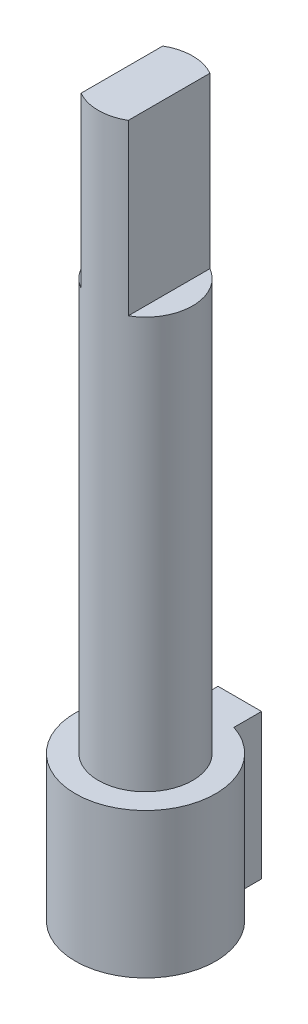
ISO-10303-21;
HEADER;
FILE_DESCRIPTION(('STEP AP214'),'2;1');
FILE_NAME('part.step','',(''),(''),'','','');
FILE_SCHEMA(('AUTOMOTIVE_DESIGN { 1 0 10303 214 1 1 1 1 }'));
ENDSEC;
DATA;
#1=APPLICATION_CONTEXT('core data for automotive mechanical design processes');
#2=APPLICATION_PROTOCOL_DEFINITION('international standard','automotive_design',2000,#1);
#3=PRODUCT_CONTEXT('',#1,'mechanical');
#4=PRODUCT('Part','Part','',(#3));
#5=PRODUCT_RELATED_PRODUCT_CATEGORY('part','',(#4));
#6=PRODUCT_DEFINITION_FORMATION('','',#4);
#7=PRODUCT_DEFINITION_CONTEXT('part definition',#1,'design');
#8=PRODUCT_DEFINITION('design','',#6,#7);
#9=PRODUCT_DEFINITION_SHAPE('','',#8);
#10=(LENGTH_UNIT() NAMED_UNIT(*) SI_UNIT(.MILLI.,.METRE.));
#11=(NAMED_UNIT(*) PLANE_ANGLE_UNIT() SI_UNIT($,.RADIAN.));
#12=(NAMED_UNIT(*) SI_UNIT($,.STERADIAN.) SOLID_ANGLE_UNIT());
#13=UNCERTAINTY_MEASURE_WITH_UNIT(LENGTH_MEASURE(1.E-05),#10,'distance_accuracy_value','');
#14=(GEOMETRIC_REPRESENTATION_CONTEXT(3) GLOBAL_UNCERTAINTY_ASSIGNED_CONTEXT((#13)) GLOBAL_UNIT_ASSIGNED_CONTEXT((#10,
#11,#12)) REPRESENTATION_CONTEXT('',''));
#15=CARTESIAN_POINT('',(0.,0.,0.));
#16=DIRECTION('',(0.,0.,1.));
#17=DIRECTION('',(1.,0.,0.));
#18=AXIS2_PLACEMENT_3D('',#15,#16,#17);
#19=CARTESIAN_POINT('',(0.,8.,0.));
#20=DIRECTION('',(0.,1.,0.));
#21=DIRECTION('',(0.,0.,1.));
#22=AXIS2_PLACEMENT_3D('',#19,#20,#21);
#23=CYLINDRICAL_SURFACE('',#22,1.95);
#24=DIRECTION('',(0.,1.,0.));
#25=VECTOR('',#24,1.);
#26=CARTESIAN_POINT('',(-0.975,23.,-1.68874953737966));
#27=LINE('',#26,#25);
#28=CARTESIAN_POINT('',(-0.975,23.,-1.68874953737966));
#29=VERTEX_POINT('',#28);
#30=CARTESIAN_POINT('',(-0.975,30.,-1.68874953737966));
#31=VERTEX_POINT('',#30);
#32=EDGE_CURVE('E147',#29,#31,#27,.T.);
#33=ORIENTED_EDGE('',*,*,#32,.T.);
#34=CARTESIAN_POINT('',(0.,30.,0.));
#35=DIRECTION('',(0.,1.,0.));
#36=DIRECTION('',(0.,0.,1.));
#37=AXIS2_PLACEMENT_3D('',#34,#35,#36);
#38=CIRCLE('',#37,1.95);
#39=CARTESIAN_POINT('',(0.975,30.,-1.68874953737966));
#40=VERTEX_POINT('',#39);
#41=EDGE_CURVE('E50',#40,#31,#38,.T.);
#42=ORIENTED_EDGE('',*,*,#41,.F.);
#43=DIRECTION('',(0.,1.,0.));
#44=VECTOR('',#43,1.);
#45=CARTESIAN_POINT('',(0.975,23.,-1.68874953737966));
#46=LINE('',#45,#44);
#47=CARTESIAN_POINT('',(0.975,23.,-1.68874953737966));
#48=VERTEX_POINT('',#47);
#49=EDGE_CURVE('E162',#48,#40,#46,.T.);
#50=ORIENTED_EDGE('',*,*,#49,.F.);
#51=CARTESIAN_POINT('',(0.,23.,0.));
#52=DIRECTION('',(0.,1.,0.));
#53=DIRECTION('',(0.,0.,1.));
#54=AXIS2_PLACEMENT_3D('',#51,#52,#53);
#55=CIRCLE('',#54,1.95);
#56=CARTESIAN_POINT('',(0.975,23.,1.68874953737966));
#57=VERTEX_POINT('',#56);
#58=EDGE_CURVE('E154',#57,#48,#55,.T.);
#59=ORIENTED_EDGE('',*,*,#58,.F.);
#60=DIRECTION('',(0.,1.,0.));
#61=VECTOR('',#60,1.);
#62=CARTESIAN_POINT('',(0.975,23.,1.68874953737966));
#63=LINE('',#62,#61);
#64=CARTESIAN_POINT('',(0.975,30.,1.68874953737966));
#65=VERTEX_POINT('',#64);
#66=EDGE_CURVE('E146',#57,#65,#63,.T.);
#67=ORIENTED_EDGE('',*,*,#66,.T.);
#68=CARTESIAN_POINT('',(-0.975,30.,1.68874953737966));
#69=VERTEX_POINT('',#68);
#70=EDGE_CURVE('E151',#69,#65,#38,.T.);
#71=ORIENTED_EDGE('',*,*,#70,.F.);
#72=DIRECTION('',(0.,1.,0.));
#73=VECTOR('',#72,1.);
#74=CARTESIAN_POINT('',(-0.975,23.,1.68874953737966));
#75=LINE('',#74,#73);
#76=CARTESIAN_POINT('',(-0.975,23.,1.68874953737966));
#77=VERTEX_POINT('',#76);
#78=EDGE_CURVE('E143',#77,#69,#75,.T.);
#79=ORIENTED_EDGE('',*,*,#78,.F.);
#80=CARTESIAN_POINT('',(0.,23.,0.));
#81=DIRECTION('',(0.,1.,0.));
#82=DIRECTION('',(0.,0.,1.));
#83=AXIS2_PLACEMENT_3D('',#80,#81,#82);
#84=CIRCLE('',#83,1.95);
#85=EDGE_CURVE('E135',#29,#77,#84,.T.);
#86=ORIENTED_EDGE('',*,*,#85,.F.);
#87=EDGE_LOOP('',(#33,#42,#50,#59,#67,#71,#79,#86));
#88=FACE_BOUND('',#87,.T.);
#89=CARTESIAN_POINT('',(0.,6.,0.));
#90=DIRECTION('',(0.,1.,0.));
#91=DIRECTION('',(0.,0.,1.));
#92=AXIS2_PLACEMENT_3D('',#89,#90,#91);
#93=CIRCLE('',#92,1.95);
#94=CARTESIAN_POINT('',(0.,6.,1.95));
#95=VERTEX_POINT('',#94);
#96=EDGE_CURVE('E115',#95,#95,#93,.T.);
#97=ORIENTED_EDGE('',*,*,#96,.T.);
#98=EDGE_LOOP('',(#97));
#99=FACE_BOUND('',#98,.T.);
#100=ADVANCED_FACE('F41',(#88,#99),#23,.T.);
#101=CARTESIAN_POINT('',(0.,30.,0.));
#102=DIRECTION('',(0.,1.,0.));
#103=DIRECTION('',(0.,0.,1.));
#104=AXIS2_PLACEMENT_3D('',#101,#102,#103);
#105=PLANE('',#104);
#106=DIRECTION('',(0.,0.,-1.));
#107=VECTOR('',#106,1.);
#108=CARTESIAN_POINT('',(-0.975,30.,-1.68874953737966));
#109=LINE('',#108,#107);
#110=EDGE_CURVE('E139',#69,#31,#109,.T.);
#111=ORIENTED_EDGE('',*,*,#110,.F.);
#112=ORIENTED_EDGE('',*,*,#70,.T.);
#113=DIRECTION('',(0.,0.,1.));
#114=VECTOR('',#113,1.);
#115=CARTESIAN_POINT('',(0.975,30.,-1.68874953737966));
#116=LINE('',#115,#114);
#117=EDGE_CURVE('E158',#40,#65,#116,.T.);
#118=ORIENTED_EDGE('',*,*,#117,.F.);
#119=ORIENTED_EDGE('',*,*,#41,.T.);
#120=EDGE_LOOP('',(#111,#112,#118,#119));
#121=FACE_BOUND('',#120,.T.);
#122=ADVANCED_FACE('F178',(#121),#105,.T.);
#123=CARTESIAN_POINT('',(0.975,23.,-1.68874953737966));
#124=DIRECTION('',(-1.,0.,0.));
#125=DIRECTION('',(0.,0.,1.));
#126=AXIS2_PLACEMENT_3D('',#123,#124,#125);
#127=PLANE('',#126);
#128=ORIENTED_EDGE('',*,*,#117,.T.);
#129=ORIENTED_EDGE('',*,*,#66,.F.);
#130=DIRECTION('',(0.,0.,1.));
#131=VECTOR('',#130,1.);
#132=CARTESIAN_POINT('',(0.975,23.,-1.68874953737966));
#133=LINE('',#132,#131);
#134=EDGE_CURVE('E157',#48,#57,#133,.T.);
#135=ORIENTED_EDGE('',*,*,#134,.F.);
#136=ORIENTED_EDGE('',*,*,#49,.T.);
#137=EDGE_LOOP('',(#128,#129,#135,#136));
#138=FACE_BOUND('',#137,.T.);
#139=ADVANCED_FACE('F205',(#138),#127,.F.);
#140=CARTESIAN_POINT('',(0.,23.,0.));
#141=DIRECTION('',(0.,1.,0.));
#142=DIRECTION('',(0.,0.,1.));
#143=AXIS2_PLACEMENT_3D('',#140,#141,#142);
#144=PLANE('',#143);
#145=ORIENTED_EDGE('',*,*,#58,.T.);
#146=ORIENTED_EDGE('',*,*,#134,.T.);
#147=EDGE_LOOP('',(#145,#146));
#148=FACE_BOUND('',#147,.T.);
#149=ADVANCED_FACE('F197',(#148),#144,.T.);
#150=CARTESIAN_POINT('',(-0.975,23.,-1.68874953737966));
#151=DIRECTION('',(1.,0.,0.));
#152=DIRECTION('',(0.,0.,-1.));
#153=AXIS2_PLACEMENT_3D('',#150,#151,#152);
#154=PLANE('',#153);
#155=ORIENTED_EDGE('',*,*,#110,.T.);
#156=ORIENTED_EDGE('',*,*,#32,.F.);
#157=DIRECTION('',(0.,0.,-1.));
#158=VECTOR('',#157,1.);
#159=CARTESIAN_POINT('',(-0.975,23.,-1.68874953737966));
#160=LINE('',#159,#158);
#161=EDGE_CURVE('E138',#77,#29,#160,.T.);
#162=ORIENTED_EDGE('',*,*,#161,.F.);
#163=ORIENTED_EDGE('',*,*,#78,.T.);
#164=EDGE_LOOP('',(#155,#156,#162,#163));
#165=FACE_BOUND('',#164,.T.);
#166=ADVANCED_FACE('F187',(#165),#154,.F.);
#167=CARTESIAN_POINT('',(0.,23.,0.));
#168=DIRECTION('',(0.,1.,0.));
#169=DIRECTION('',(0.,0.,1.));
#170=AXIS2_PLACEMENT_3D('',#167,#168,#169);
#171=PLANE('',#170);
#172=ORIENTED_EDGE('',*,*,#85,.T.);
#173=ORIENTED_EDGE('',*,*,#161,.T.);
#174=EDGE_LOOP('',(#172,#173));
#175=FACE_BOUND('',#174,.T.);
#176=ADVANCED_FACE('F189',(#175),#171,.T.);
#177=CARTESIAN_POINT('',(0.,6.,0.));
#178=DIRECTION('',(0.,1.,0.));
#179=DIRECTION('',(0.,0.,1.));
#180=AXIS2_PLACEMENT_3D('',#177,#178,#179);
#181=PLANE('',#180);
#182=CARTESIAN_POINT('',(0.,6.,0.));
#183=DIRECTION('',(0.,1.,0.));
#184=DIRECTION('',(0.,0.,1.));
#185=AXIS2_PLACEMENT_3D('',#182,#183,#184);
#186=CIRCLE('',#185,2.9);
#187=CARTESIAN_POINT('',(-0.9,6.00000000000001,-2.75680975041804));
#188=VERTEX_POINT('',#187);
#189=CARTESIAN_POINT('',(0.9,6.00000000000001,-2.75680975041804));
#190=VERTEX_POINT('',#189);
#191=EDGE_CURVE('E107',#188,#190,#186,.T.);
#192=ORIENTED_EDGE('',*,*,#191,.T.);
#193=DIRECTION('',(0.,0.,1.));
#194=VECTOR('',#193,1.);
#195=CARTESIAN_POINT('',(0.9,6.00000000000001,-2.75680975041804));
#196=LINE('',#195,#194);
#197=CARTESIAN_POINT('',(0.9,6.00000000000001,-3.89842712474619));
#198=VERTEX_POINT('',#197);
#199=EDGE_CURVE('E285',#198,#190,#196,.T.);
#200=ORIENTED_EDGE('',*,*,#199,.F.);
#201=DIRECTION('',(1.,0.,0.));
#202=VECTOR('',#201,1.);
#203=CARTESIAN_POINT('',(-0.9,6.00000000000001,-3.89842712474619));
#204=LINE('',#203,#202);
#205=CARTESIAN_POINT('',(-0.9,6.00000000000001,-3.89842712474619));
#206=VERTEX_POINT('',#205);
#207=EDGE_CURVE('E57',#206,#198,#204,.T.);
#208=ORIENTED_EDGE('',*,*,#207,.F.);
#209=DIRECTION('',(0.,0.,-1.));
#210=VECTOR('',#209,1.);
#211=CARTESIAN_POINT('',(-0.9,6.00000000000001,-2.75680975041804));
#212=LINE('',#211,#210);
#213=EDGE_CURVE('E11',#188,#206,#212,.T.);
#214=ORIENTED_EDGE('',*,*,#213,.F.);
#215=EDGE_LOOP('',(#192,#200,#208,#214));
#216=FACE_BOUND('',#215,.T.);
#217=ORIENTED_EDGE('',*,*,#96,.F.);
#218=EDGE_LOOP('',(#217));
#219=FACE_BOUND('',#218,.T.);
#220=ADVANCED_FACE('F117',(#216,#219),#181,.T.);
#221=CARTESIAN_POINT('',(0.,0.,0.));
#222=DIRECTION('',(0.,1.,0.));
#223=DIRECTION('',(0.,0.,1.));
#224=AXIS2_PLACEMENT_3D('',#221,#222,#223);
#225=PLANE('',#224);
#226=CARTESIAN_POINT('',(0.,0.,0.));
#227=DIRECTION('',(0.,-1.,0.));
#228=DIRECTION('',(0.,0.,-1.));
#229=AXIS2_PLACEMENT_3D('',#226,#227,#228);
#230=CIRCLE('',#229,2.9);
#231=CARTESIAN_POINT('',(0.9,0.,-2.75680975041804));
#232=VERTEX_POINT('',#231);
#233=CARTESIAN_POINT('',(-0.9,0.,-2.75680975041804));
#234=VERTEX_POINT('',#233);
#235=EDGE_CURVE('E295',#232,#234,#230,.T.);
#236=ORIENTED_EDGE('',*,*,#235,.T.);
#237=DIRECTION('',(0.,0.,-1.));
#238=VECTOR('',#237,1.);
#239=CARTESIAN_POINT('',(-0.9,0.,-2.75680975041804));
#240=LINE('',#239,#238);
#241=CARTESIAN_POINT('',(-0.9,0.,-3.89842712474619));
#242=VERTEX_POINT('',#241);
#243=EDGE_CURVE('E121',#234,#242,#240,.T.);
#244=ORIENTED_EDGE('',*,*,#243,.T.);
#245=DIRECTION('',(1.,0.,0.));
#246=VECTOR('',#245,1.);
#247=CARTESIAN_POINT('',(-0.9,0.,-3.89842712474619));
#248=LINE('',#247,#246);
#249=CARTESIAN_POINT('',(0.9,0.,-3.89842712474619));
#250=VERTEX_POINT('',#249);
#251=EDGE_CURVE('E131',#242,#250,#248,.T.);
#252=ORIENTED_EDGE('',*,*,#251,.T.);
#253=DIRECTION('',(0.,0.,1.));
#254=VECTOR('',#253,1.);
#255=CARTESIAN_POINT('',(0.9,0.,-2.75680975041804));
#256=LINE('',#255,#254);
#257=EDGE_CURVE('E124',#250,#232,#256,.T.);
#258=ORIENTED_EDGE('',*,*,#257,.T.);
#259=EDGE_LOOP('',(#236,#244,#252,#258));
#260=FACE_BOUND('',#259,.T.);
#261=ADVANCED_FACE('F43',(#260),#225,.F.);
#262=CARTESIAN_POINT('',(-0.9,100.,-2.75680975041804));
#263=DIRECTION('',(-1.,0.,0.));
#264=DIRECTION('',(0.,0.,1.));
#265=AXIS2_PLACEMENT_3D('',#262,#263,#264);
#266=PLANE('',#265);
#267=DIRECTION('',(0.,-1.,0.));
#268=VECTOR('',#267,1.);
#269=CARTESIAN_POINT('',(-0.9,100.,-2.75680975041804));
#270=LINE('',#269,#268);
#271=EDGE_CURVE('E111',#188,#234,#270,.T.);
#272=ORIENTED_EDGE('',*,*,#271,.F.);
#273=ORIENTED_EDGE('',*,*,#213,.T.);
#274=DIRECTION('',(0.,-1.,0.));
#275=VECTOR('',#274,1.);
#276=CARTESIAN_POINT('',(-0.9,100.,-3.89842712474619));
#277=LINE('',#276,#275);
#278=EDGE_CURVE('E63',#206,#242,#277,.T.);
#279=ORIENTED_EDGE('',*,*,#278,.T.);
#280=ORIENTED_EDGE('',*,*,#243,.F.);
#281=EDGE_LOOP('',(#272,#273,#279,#280));
#282=FACE_BOUND('',#281,.T.);
#283=ADVANCED_FACE('F119',(#282),#266,.T.);
#284=CARTESIAN_POINT('',(-0.9,100.,-3.89842712474619));
#285=DIRECTION('',(0.,0.,-1.));
#286=DIRECTION('',(-1.,0.,0.));
#287=AXIS2_PLACEMENT_3D('',#284,#285,#286);
#288=PLANE('',#287);
#289=ORIENTED_EDGE('',*,*,#278,.F.);
#290=ORIENTED_EDGE('',*,*,#207,.T.);
#291=DIRECTION('',(0.,-1.,0.));
#292=VECTOR('',#291,1.);
#293=CARTESIAN_POINT('',(0.9,100.,-3.89842712474619));
#294=LINE('',#293,#292);
#295=EDGE_CURVE('E128',#198,#250,#294,.T.);
#296=ORIENTED_EDGE('',*,*,#295,.T.);
#297=ORIENTED_EDGE('',*,*,#251,.F.);
#298=EDGE_LOOP('',(#289,#290,#296,#297));
#299=FACE_BOUND('',#298,.T.);
#300=ADVANCED_FACE('F254',(#299),#288,.T.);
#301=CARTESIAN_POINT('',(0.9,100.,-2.75680975041804));
#302=DIRECTION('',(1.,0.,0.));
#303=DIRECTION('',(0.,0.,-1.));
#304=AXIS2_PLACEMENT_3D('',#301,#302,#303);
#305=PLANE('',#304);
#306=ORIENTED_EDGE('',*,*,#295,.F.);
#307=ORIENTED_EDGE('',*,*,#199,.T.);
#308=DIRECTION('',(0.,-1.,0.));
#309=VECTOR('',#308,1.);
#310=CARTESIAN_POINT('',(0.9,100.,-2.75680975041804));
#311=LINE('',#310,#309);
#312=EDGE_CURVE('E112',#190,#232,#311,.T.);
#313=ORIENTED_EDGE('',*,*,#312,.T.);
#314=ORIENTED_EDGE('',*,*,#257,.F.);
#315=EDGE_LOOP('',(#306,#307,#313,#314));
#316=FACE_BOUND('',#315,.T.);
#317=ADVANCED_FACE('F263',(#316),#305,.T.);
#318=CARTESIAN_POINT('',(0.,100.,0.));
#319=DIRECTION('',(0.,-1.,0.));
#320=DIRECTION('',(0.,0.,-1.));
#321=AXIS2_PLACEMENT_3D('',#318,#319,#320);
#322=CYLINDRICAL_SURFACE('',#321,2.9);
#323=ORIENTED_EDGE('',*,*,#191,.F.);
#324=ORIENTED_EDGE('',*,*,#271,.T.);
#325=ORIENTED_EDGE('',*,*,#235,.F.);
#326=ORIENTED_EDGE('',*,*,#312,.F.);
#327=EDGE_LOOP('',(#323,#324,#325,#326));
#328=FACE_BOUND('',#327,.T.);
#329=ADVANCED_FACE('F108',(#328),#322,.T.);
#330=CLOSED_SHELL('',(#100,#122,#139,#149,#166,#176,#220,#261,#283,#300,#317,#329));
#331=MANIFOLD_SOLID_BREP('B2',#330);
#332=ADVANCED_BREP_SHAPE_REPRESENTATION('',(#18,#331),#14);
#333=SHAPE_DEFINITION_REPRESENTATION(#9,#332);
ENDSEC;
END-ISO-10303-21;
